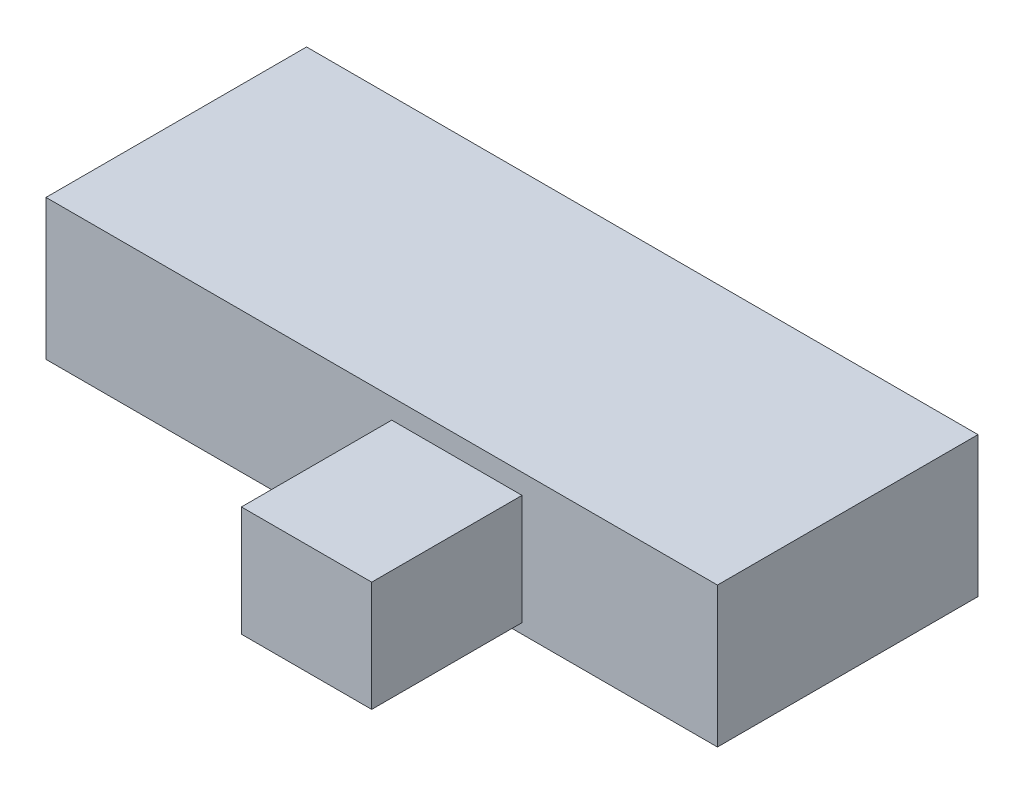
ISO-10303-21;
HEADER;
FILE_DESCRIPTION(('STEP AP214'),'2;1');
FILE_NAME('part.step','',(''),(''),'','','');
FILE_SCHEMA(('AUTOMOTIVE_DESIGN { 1 0 10303 214 1 1 1 1 }'));
ENDSEC;
DATA;
#1=APPLICATION_CONTEXT('core data for automotive mechanical design processes');
#2=APPLICATION_PROTOCOL_DEFINITION('international standard','automotive_design',2000,#1);
#3=PRODUCT_CONTEXT('',#1,'mechanical');
#4=PRODUCT('Part','Part','',(#3));
#5=PRODUCT_RELATED_PRODUCT_CATEGORY('part','',(#4));
#6=PRODUCT_DEFINITION_FORMATION('','',#4);
#7=PRODUCT_DEFINITION_CONTEXT('part definition',#1,'design');
#8=PRODUCT_DEFINITION('design','',#6,#7);
#9=PRODUCT_DEFINITION_SHAPE('','',#8);
#10=(LENGTH_UNIT() NAMED_UNIT(*) SI_UNIT(.MILLI.,.METRE.));
#11=(NAMED_UNIT(*) PLANE_ANGLE_UNIT() SI_UNIT($,.RADIAN.));
#12=(NAMED_UNIT(*) SI_UNIT($,.STERADIAN.) SOLID_ANGLE_UNIT());
#13=UNCERTAINTY_MEASURE_WITH_UNIT(LENGTH_MEASURE(1.E-05),#10,'distance_accuracy_value','');
#14=(GEOMETRIC_REPRESENTATION_CONTEXT(3) GLOBAL_UNCERTAINTY_ASSIGNED_CONTEXT((#13)) GLOBAL_UNIT_ASSIGNED_CONTEXT((#10,
#11,#12)) REPRESENTATION_CONTEXT('',''));
#15=CARTESIAN_POINT('',(0.,0.,0.));
#16=DIRECTION('',(0.,0.,1.));
#17=DIRECTION('',(1.,0.,0.));
#18=AXIS2_PLACEMENT_3D('',#15,#16,#17);
#19=CARTESIAN_POINT('',(-3.35,1.4,1.3));
#20=DIRECTION('',(0.,0.,-1.));
#21=DIRECTION('',(-1.,0.,0.));
#22=AXIS2_PLACEMENT_3D('',#19,#20,#21);
#23=PLANE('',#22);
#24=DIRECTION('',(1.,0.,0.));
#25=VECTOR('',#24,1.);
#26=CARTESIAN_POINT('',(-3.35,0.,1.3));
#27=LINE('',#26,#25);
#28=CARTESIAN_POINT('',(-3.35,0.,1.3));
#29=VERTEX_POINT('',#28);
#30=CARTESIAN_POINT('',(3.35,0.,1.3));
#31=VERTEX_POINT('',#30);
#32=EDGE_CURVE('E115',#29,#31,#27,.T.);
#33=ORIENTED_EDGE('',*,*,#32,.T.);
#34=DIRECTION('',(0.,-1.,0.));
#35=VECTOR('',#34,1.);
#36=CARTESIAN_POINT('',(3.35,1.4,1.3));
#37=LINE('',#36,#35);
#38=CARTESIAN_POINT('',(3.35,1.4,1.3));
#39=VERTEX_POINT('',#38);
#40=EDGE_CURVE('E120',#39,#31,#37,.T.);
#41=ORIENTED_EDGE('',*,*,#40,.F.);
#42=DIRECTION('',(1.,0.,0.));
#43=VECTOR('',#42,1.);
#44=CARTESIAN_POINT('',(-3.35,1.4,1.3));
#45=LINE('',#44,#43);
#46=CARTESIAN_POINT('',(-3.35,1.4,1.3));
#47=VERTEX_POINT('',#46);
#48=EDGE_CURVE('E119',#47,#39,#45,.T.);
#49=ORIENTED_EDGE('',*,*,#48,.F.);
#50=DIRECTION('',(0.,-1.,0.));
#51=VECTOR('',#50,1.);
#52=CARTESIAN_POINT('',(-3.35,1.4,1.3));
#53=LINE('',#52,#51);
#54=EDGE_CURVE('E128',#47,#29,#53,.T.);
#55=ORIENTED_EDGE('',*,*,#54,.T.);
#56=EDGE_LOOP('',(#33,#41,#49,#55));
#57=FACE_BOUND('',#56,.T.);
#58=DIRECTION('',(0.,1.,0.));
#59=VECTOR('',#58,1.);
#60=CARTESIAN_POINT('',(1.4,1.2,1.3));
#61=LINE('',#60,#59);
#62=CARTESIAN_POINT('',(1.4,0.1,1.3));
#63=VERTEX_POINT('',#62);
#64=CARTESIAN_POINT('',(1.4,1.2,1.3));
#65=VERTEX_POINT('',#64);
#66=EDGE_CURVE('E101',#63,#65,#61,.T.);
#67=ORIENTED_EDGE('',*,*,#66,.F.);
#68=DIRECTION('',(1.,0.,0.));
#69=VECTOR('',#68,1.);
#70=CARTESIAN_POINT('',(0.1,0.1,1.3));
#71=LINE('',#70,#69);
#72=CARTESIAN_POINT('',(0.1,0.1,1.3));
#73=VERTEX_POINT('',#72);
#74=EDGE_CURVE('E98',#73,#63,#71,.T.);
#75=ORIENTED_EDGE('',*,*,#74,.F.);
#76=DIRECTION('',(0.,-1.,0.));
#77=VECTOR('',#76,1.);
#78=CARTESIAN_POINT('',(0.1,1.2,1.3));
#79=LINE('',#78,#77);
#80=CARTESIAN_POINT('',(0.1,1.2,1.3));
#81=VERTEX_POINT('',#80);
#82=EDGE_CURVE('E36',#81,#73,#79,.T.);
#83=ORIENTED_EDGE('',*,*,#82,.F.);
#84=DIRECTION('',(-1.,0.,0.));
#85=VECTOR('',#84,1.);
#86=CARTESIAN_POINT('',(0.1,1.2,1.3));
#87=LINE('',#86,#85);
#88=EDGE_CURVE('E31',#65,#81,#87,.T.);
#89=ORIENTED_EDGE('',*,*,#88,.F.);
#90=EDGE_LOOP('',(#67,#75,#83,#89));
#91=FACE_BOUND('',#90,.T.);
#92=ADVANCED_FACE('F16',(#57,#91),#23,.F.);
#93=CARTESIAN_POINT('',(3.35,1.4,-1.3));
#94=DIRECTION('',(-1.,0.,0.));
#95=DIRECTION('',(0.,0.,1.));
#96=AXIS2_PLACEMENT_3D('',#93,#94,#95);
#97=PLANE('',#96);
#98=DIRECTION('',(0.,0.,-1.));
#99=VECTOR('',#98,1.);
#100=CARTESIAN_POINT('',(3.35,0.,-1.3));
#101=LINE('',#100,#99);
#102=CARTESIAN_POINT('',(3.35,0.,-1.3));
#103=VERTEX_POINT('',#102);
#104=EDGE_CURVE('E102',#31,#103,#101,.T.);
#105=ORIENTED_EDGE('',*,*,#104,.T.);
#106=DIRECTION('',(0.,-1.,0.));
#107=VECTOR('',#106,1.);
#108=CARTESIAN_POINT('',(3.35,1.4,-1.3));
#109=LINE('',#108,#107);
#110=CARTESIAN_POINT('',(3.35,1.4,-1.3));
#111=VERTEX_POINT('',#110);
#112=EDGE_CURVE('E11',#111,#103,#109,.T.);
#113=ORIENTED_EDGE('',*,*,#112,.F.);
#114=DIRECTION('',(0.,0.,-1.));
#115=VECTOR('',#114,1.);
#116=CARTESIAN_POINT('',(3.35,1.4,-1.3));
#117=LINE('',#116,#115);
#118=EDGE_CURVE('E111',#39,#111,#117,.T.);
#119=ORIENTED_EDGE('',*,*,#118,.F.);
#120=ORIENTED_EDGE('',*,*,#40,.T.);
#121=EDGE_LOOP('',(#105,#113,#119,#120));
#122=FACE_BOUND('',#121,.T.);
#123=ADVANCED_FACE('F18',(#122),#97,.F.);
#124=CARTESIAN_POINT('',(-3.35,1.4,-1.3));
#125=DIRECTION('',(0.,0.,1.));
#126=DIRECTION('',(1.,0.,0.));
#127=AXIS2_PLACEMENT_3D('',#124,#125,#126);
#128=PLANE('',#127);
#129=DIRECTION('',(-1.,0.,0.));
#130=VECTOR('',#129,1.);
#131=CARTESIAN_POINT('',(-3.35,0.,-1.3));
#132=LINE('',#131,#130);
#133=CARTESIAN_POINT('',(-3.35,0.,-1.3));
#134=VERTEX_POINT('',#133);
#135=EDGE_CURVE('E105',#103,#134,#132,.T.);
#136=ORIENTED_EDGE('',*,*,#135,.T.);
#137=DIRECTION('',(0.,-1.,0.));
#138=VECTOR('',#137,1.);
#139=CARTESIAN_POINT('',(-3.35,1.4,-1.3));
#140=LINE('',#139,#138);
#141=CARTESIAN_POINT('',(-3.35,1.4,-1.3));
#142=VERTEX_POINT('',#141);
#143=EDGE_CURVE('E24',#142,#134,#140,.T.);
#144=ORIENTED_EDGE('',*,*,#143,.F.);
#145=DIRECTION('',(-1.,0.,0.));
#146=VECTOR('',#145,1.);
#147=CARTESIAN_POINT('',(-3.35,1.4,-1.3));
#148=LINE('',#147,#146);
#149=EDGE_CURVE('E114',#111,#142,#148,.T.);
#150=ORIENTED_EDGE('',*,*,#149,.F.);
#151=ORIENTED_EDGE('',*,*,#112,.T.);
#152=EDGE_LOOP('',(#136,#144,#150,#151));
#153=FACE_BOUND('',#152,.T.);
#154=ADVANCED_FACE('F150',(#153),#128,.F.);
#155=CARTESIAN_POINT('',(-3.35,1.4,-1.3));
#156=DIRECTION('',(1.,0.,0.));
#157=DIRECTION('',(0.,0.,-1.));
#158=AXIS2_PLACEMENT_3D('',#155,#156,#157);
#159=PLANE('',#158);
#160=DIRECTION('',(0.,0.,1.));
#161=VECTOR('',#160,1.);
#162=CARTESIAN_POINT('',(-3.35,0.,-1.3));
#163=LINE('',#162,#161);
#164=EDGE_CURVE('E123',#134,#29,#163,.T.);
#165=ORIENTED_EDGE('',*,*,#164,.T.);
#166=ORIENTED_EDGE('',*,*,#54,.F.);
#167=DIRECTION('',(0.,0.,1.));
#168=VECTOR('',#167,1.);
#169=CARTESIAN_POINT('',(-3.35,1.4,-1.3));
#170=LINE('',#169,#168);
#171=EDGE_CURVE('E117',#142,#47,#170,.T.);
#172=ORIENTED_EDGE('',*,*,#171,.F.);
#173=ORIENTED_EDGE('',*,*,#143,.T.);
#174=EDGE_LOOP('',(#165,#166,#172,#173));
#175=FACE_BOUND('',#174,.T.);
#176=ADVANCED_FACE('F135',(#175),#159,.F.);
#177=CARTESIAN_POINT('',(0.,1.4,0.));
#178=DIRECTION('',(0.,1.,0.));
#179=DIRECTION('',(0.,0.,1.));
#180=AXIS2_PLACEMENT_3D('',#177,#178,#179);
#181=PLANE('',#180);
#182=ORIENTED_EDGE('',*,*,#118,.T.);
#183=ORIENTED_EDGE('',*,*,#149,.T.);
#184=ORIENTED_EDGE('',*,*,#171,.T.);
#185=ORIENTED_EDGE('',*,*,#48,.T.);
#186=EDGE_LOOP('',(#182,#183,#184,#185));
#187=FACE_BOUND('',#186,.T.);
#188=ADVANCED_FACE('F149',(#187),#181,.T.);
#189=CARTESIAN_POINT('',(0.,0.,0.));
#190=DIRECTION('',(0.,1.,0.));
#191=DIRECTION('',(0.,0.,1.));
#192=AXIS2_PLACEMENT_3D('',#189,#190,#191);
#193=PLANE('',#192);
#194=ORIENTED_EDGE('',*,*,#104,.F.);
#195=ORIENTED_EDGE('',*,*,#32,.F.);
#196=ORIENTED_EDGE('',*,*,#164,.F.);
#197=ORIENTED_EDGE('',*,*,#135,.F.);
#198=EDGE_LOOP('',(#194,#195,#196,#197));
#199=FACE_BOUND('',#198,.T.);
#200=ADVANCED_FACE('F141',(#199),#193,.F.);
#201=CARTESIAN_POINT('',(1.4,1.2,2.8));
#202=DIRECTION('',(-1.,0.,0.));
#203=DIRECTION('',(0.,-1.,0.));
#204=AXIS2_PLACEMENT_3D('',#201,#202,#203);
#205=PLANE('',#204);
#206=ORIENTED_EDGE('',*,*,#66,.T.);
#207=DIRECTION('',(0.,0.,-1.));
#208=VECTOR('',#207,1.);
#209=CARTESIAN_POINT('',(1.4,1.2,2.8));
#210=LINE('',#209,#208);
#211=CARTESIAN_POINT('',(1.4,1.2,2.8));
#212=VERTEX_POINT('',#211);
#213=EDGE_CURVE('E82',#212,#65,#210,.T.);
#214=ORIENTED_EDGE('',*,*,#213,.F.);
#215=DIRECTION('',(0.,1.,0.));
#216=VECTOR('',#215,1.);
#217=CARTESIAN_POINT('',(1.4,1.2,2.8));
#218=LINE('',#217,#216);
#219=CARTESIAN_POINT('',(1.4,0.1,2.8));
#220=VERTEX_POINT('',#219);
#221=EDGE_CURVE('E89',#220,#212,#218,.T.);
#222=ORIENTED_EDGE('',*,*,#221,.F.);
#223=DIRECTION('',(0.,0.,-1.));
#224=VECTOR('',#223,1.);
#225=CARTESIAN_POINT('',(1.4,0.1,2.8));
#226=LINE('',#225,#224);
#227=EDGE_CURVE('E294',#220,#63,#226,.T.);
#228=ORIENTED_EDGE('',*,*,#227,.T.);
#229=EDGE_LOOP('',(#206,#214,#222,#228));
#230=FACE_BOUND('',#229,.T.);
#231=ADVANCED_FACE('F100',(#230),#205,.F.);
#232=CARTESIAN_POINT('',(0.1,1.2,2.8));
#233=DIRECTION('',(0.,-1.,0.));
#234=DIRECTION('',(0.,0.,-1.));
#235=AXIS2_PLACEMENT_3D('',#232,#233,#234);
#236=PLANE('',#235);
#237=ORIENTED_EDGE('',*,*,#88,.T.);
#238=DIRECTION('',(0.,0.,-1.));
#239=VECTOR('',#238,1.);
#240=CARTESIAN_POINT('',(0.1,1.2,2.8));
#241=LINE('',#240,#239);
#242=CARTESIAN_POINT('',(0.1,1.2,2.8));
#243=VERTEX_POINT('',#242);
#244=EDGE_CURVE('E85',#243,#81,#241,.T.);
#245=ORIENTED_EDGE('',*,*,#244,.F.);
#246=DIRECTION('',(-1.,0.,0.));
#247=VECTOR('',#246,1.);
#248=CARTESIAN_POINT('',(0.1,1.2,2.8));
#249=LINE('',#248,#247);
#250=EDGE_CURVE('E78',#212,#243,#249,.T.);
#251=ORIENTED_EDGE('',*,*,#250,.F.);
#252=ORIENTED_EDGE('',*,*,#213,.T.);
#253=EDGE_LOOP('',(#237,#245,#251,#252));
#254=FACE_BOUND('',#253,.T.);
#255=ADVANCED_FACE('F80',(#254),#236,.F.);
#256=CARTESIAN_POINT('',(0.1,1.2,2.8));
#257=DIRECTION('',(1.,0.,0.));
#258=DIRECTION('',(0.,1.,0.));
#259=AXIS2_PLACEMENT_3D('',#256,#257,#258);
#260=PLANE('',#259);
#261=ORIENTED_EDGE('',*,*,#82,.T.);
#262=DIRECTION('',(0.,0.,-1.));
#263=VECTOR('',#262,1.);
#264=CARTESIAN_POINT('',(0.1,0.1,2.8));
#265=LINE('',#264,#263);
#266=CARTESIAN_POINT('',(0.1,0.1,2.8));
#267=VERTEX_POINT('',#266);
#268=EDGE_CURVE('E107',#267,#73,#265,.T.);
#269=ORIENTED_EDGE('',*,*,#268,.F.);
#270=DIRECTION('',(0.,-1.,0.));
#271=VECTOR('',#270,1.);
#272=CARTESIAN_POINT('',(0.1,1.2,2.8));
#273=LINE('',#272,#271);
#274=EDGE_CURVE('E88',#243,#267,#273,.T.);
#275=ORIENTED_EDGE('',*,*,#274,.F.);
#276=ORIENTED_EDGE('',*,*,#244,.T.);
#277=EDGE_LOOP('',(#261,#269,#275,#276));
#278=FACE_BOUND('',#277,.T.);
#279=ADVANCED_FACE('F173',(#278),#260,.F.);
#280=CARTESIAN_POINT('',(0.1,0.1,2.8));
#281=DIRECTION('',(0.,1.,0.));
#282=DIRECTION('',(0.,0.,1.));
#283=AXIS2_PLACEMENT_3D('',#280,#281,#282);
#284=PLANE('',#283);
#285=ORIENTED_EDGE('',*,*,#74,.T.);
#286=ORIENTED_EDGE('',*,*,#227,.F.);
#287=DIRECTION('',(1.,0.,0.));
#288=VECTOR('',#287,1.);
#289=CARTESIAN_POINT('',(0.1,0.1,2.8));
#290=LINE('',#289,#288);
#291=EDGE_CURVE('E94',#267,#220,#290,.T.);
#292=ORIENTED_EDGE('',*,*,#291,.F.);
#293=ORIENTED_EDGE('',*,*,#268,.T.);
#294=EDGE_LOOP('',(#285,#286,#292,#293));
#295=FACE_BOUND('',#294,.T.);
#296=ADVANCED_FACE('F176',(#295),#284,.F.);
#297=CARTESIAN_POINT('',(0.,0.,2.8));
#298=DIRECTION('',(0.,0.,1.));
#299=DIRECTION('',(1.,0.,0.));
#300=AXIS2_PLACEMENT_3D('',#297,#298,#299);
#301=PLANE('',#300);
#302=ORIENTED_EDGE('',*,*,#221,.T.);
#303=ORIENTED_EDGE('',*,*,#250,.T.);
#304=ORIENTED_EDGE('',*,*,#274,.T.);
#305=ORIENTED_EDGE('',*,*,#291,.T.);
#306=EDGE_LOOP('',(#302,#303,#304,#305));
#307=FACE_BOUND('',#306,.T.);
#308=ADVANCED_FACE('F92',(#307),#301,.T.);
#309=CLOSED_SHELL('',(#92,#123,#154,#176,#188,#200,#231,#255,#279,#296,#308));
#310=MANIFOLD_SOLID_BREP('B1',#309);
#311=ADVANCED_BREP_SHAPE_REPRESENTATION('',(#18,#310),#14);
#312=SHAPE_DEFINITION_REPRESENTATION(#9,#311);
ENDSEC;
END-ISO-10303-21;
